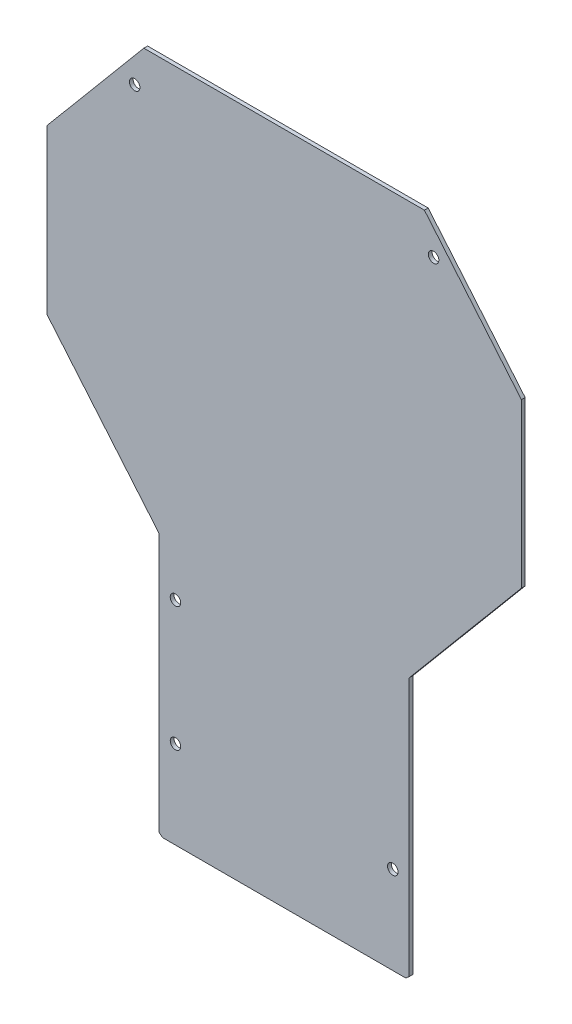
ISO-10303-21;
HEADER;
FILE_DESCRIPTION(('STEP AP214'),'2;1');
FILE_NAME('part.step','',(''),(''),'','','');
FILE_SCHEMA(('AUTOMOTIVE_DESIGN { 1 0 10303 214 1 1 1 1 }'));
ENDSEC;
DATA;
#1=APPLICATION_CONTEXT('core data for automotive mechanical design processes');
#2=APPLICATION_PROTOCOL_DEFINITION('international standard','automotive_design',2000,#1);
#3=PRODUCT_CONTEXT('',#1,'mechanical');
#4=PRODUCT('Part','Part','',(#3));
#5=PRODUCT_RELATED_PRODUCT_CATEGORY('part','',(#4));
#6=PRODUCT_DEFINITION_FORMATION('','',#4);
#7=PRODUCT_DEFINITION_CONTEXT('part definition',#1,'design');
#8=PRODUCT_DEFINITION('design','',#6,#7);
#9=PRODUCT_DEFINITION_SHAPE('','',#8);
#10=(LENGTH_UNIT() NAMED_UNIT(*) SI_UNIT(.MILLI.,.METRE.));
#11=(NAMED_UNIT(*) PLANE_ANGLE_UNIT() SI_UNIT($,.RADIAN.));
#12=(NAMED_UNIT(*) SI_UNIT($,.STERADIAN.) SOLID_ANGLE_UNIT());
#13=UNCERTAINTY_MEASURE_WITH_UNIT(LENGTH_MEASURE(1.E-05),#10,'distance_accuracy_value','');
#14=(GEOMETRIC_REPRESENTATION_CONTEXT(3) GLOBAL_UNCERTAINTY_ASSIGNED_CONTEXT((#13)) GLOBAL_UNIT_ASSIGNED_CONTEXT((#10,
#11,#12)) REPRESENTATION_CONTEXT('',''));
#15=CARTESIAN_POINT('',(0.,0.,0.));
#16=DIRECTION('',(0.,0.,1.));
#17=DIRECTION('',(1.,0.,0.));
#18=AXIS2_PLACEMENT_3D('',#15,#16,#17);
#19=CARTESIAN_POINT('',(49.1570232721275,-31.4887292628743,1.5));
#20=DIRECTION('',(-1.,0.,0.));
#21=DIRECTION('',(0.,-1.,0.));
#22=AXIS2_PLACEMENT_3D('',#19,#20,#21);
#23=PLANE('',#22);
#24=DIRECTION('',(0.,1.,0.));
#25=VECTOR('',#24,1.);
#26=CARTESIAN_POINT('',(49.1570232721275,-31.4887292628743,0.));
#27=LINE('',#26,#25);
#28=CARTESIAN_POINT('',(49.1570232721276,-135.082673957974,0.));
#29=VERTEX_POINT('',#28);
#30=CARTESIAN_POINT('',(49.1570232721275,-31.4887292628743,0.));
#31=VERTEX_POINT('',#30);
#32=EDGE_CURVE('E153',#29,#31,#27,.T.);
#33=ORIENTED_EDGE('',*,*,#32,.T.);
#34=DIRECTION('',(0.,0.,-1.));
#35=VECTOR('',#34,1.);
#36=CARTESIAN_POINT('',(49.1570232721275,-31.4887292628743,1.5));
#37=LINE('',#36,#35);
#38=CARTESIAN_POINT('',(49.1570232721275,-31.4887292628743,1.5));
#39=VERTEX_POINT('',#38);
#40=EDGE_CURVE('E11',#39,#31,#37,.T.);
#41=ORIENTED_EDGE('',*,*,#40,.F.);
#42=DIRECTION('',(0.,1.,0.));
#43=VECTOR('',#42,1.);
#44=CARTESIAN_POINT('',(49.1570232721275,-31.4887292628743,1.5));
#45=LINE('',#44,#43);
#46=CARTESIAN_POINT('',(49.1570232721276,-135.082673957974,1.5));
#47=VERTEX_POINT('',#46);
#48=EDGE_CURVE('E176',#47,#39,#45,.T.);
#49=ORIENTED_EDGE('',*,*,#48,.F.);
#50=DIRECTION('',(0.,0.,-1.));
#51=VECTOR('',#50,1.);
#52=CARTESIAN_POINT('',(49.1570232721276,-135.082673957974,1.5));
#53=LINE('',#52,#51);
#54=EDGE_CURVE('E149',#47,#29,#53,.T.);
#55=ORIENTED_EDGE('',*,*,#54,.T.);
#56=EDGE_LOOP('',(#33,#41,#49,#55));
#57=FACE_BOUND('',#56,.T.);
#58=ADVANCED_FACE('F33',(#57),#23,.F.);
#59=CARTESIAN_POINT('',(94.1570232721273,22.1401824038646,1.5));
#60=DIRECTION('',(-0.766044443118977,0.642787609686541,0.));
#61=DIRECTION('',(-0.642787609686541,-0.766044443118977,0.));
#62=AXIS2_PLACEMENT_3D('',#59,#60,#61);
#63=PLANE('',#62);
#64=DIRECTION('',(0.642787609686541,0.766044443118977,0.));
#65=VECTOR('',#64,1.);
#66=CARTESIAN_POINT('',(94.1570232721273,22.1401824038646,0.));
#67=LINE('',#66,#65);
#68=CARTESIAN_POINT('',(94.1570232721273,22.1401824038646,0.));
#69=VERTEX_POINT('',#68);
#70=EDGE_CURVE('E156',#31,#69,#67,.T.);
#71=ORIENTED_EDGE('',*,*,#70,.T.);
#72=DIRECTION('',(0.,0.,-1.));
#73=VECTOR('',#72,1.);
#74=CARTESIAN_POINT('',(94.1570232721273,22.1401824038646,1.5));
#75=LINE('',#74,#73);
#76=CARTESIAN_POINT('',(94.1570232721273,22.1401824038646,1.5));
#77=VERTEX_POINT('',#76);
#78=EDGE_CURVE('E41',#77,#69,#75,.T.);
#79=ORIENTED_EDGE('',*,*,#78,.F.);
#80=DIRECTION('',(0.642787609686541,0.766044443118977,0.));
#81=VECTOR('',#80,1.);
#82=CARTESIAN_POINT('',(94.1570232721273,22.1401824038646,1.5));
#83=LINE('',#82,#81);
#84=EDGE_CURVE('E104',#39,#77,#83,.T.);
#85=ORIENTED_EDGE('',*,*,#84,.F.);
#86=ORIENTED_EDGE('',*,*,#40,.T.);
#87=EDGE_LOOP('',(#71,#79,#85,#86));
#88=FACE_BOUND('',#87,.T.);
#89=ADVANCED_FACE('F255',(#88),#63,.F.);
#90=CARTESIAN_POINT('',(94.1570232721273,87.5266959780915,1.5));
#91=DIRECTION('',(-1.,0.,0.));
#92=DIRECTION('',(0.,-1.,0.));
#93=AXIS2_PLACEMENT_3D('',#90,#91,#92);
#94=PLANE('',#93);
#95=DIRECTION('',(0.,1.,0.));
#96=VECTOR('',#95,1.);
#97=CARTESIAN_POINT('',(94.1570232721273,87.5266959780915,0.));
#98=LINE('',#97,#96);
#99=CARTESIAN_POINT('',(94.1570232721273,87.5266959780915,0.));
#100=VERTEX_POINT('',#99);
#101=EDGE_CURVE('E159',#69,#100,#98,.T.);
#102=ORIENTED_EDGE('',*,*,#101,.T.);
#103=DIRECTION('',(0.,0.,-1.));
#104=VECTOR('',#103,1.);
#105=CARTESIAN_POINT('',(94.1570232721273,87.5266959780915,1.5));
#106=LINE('',#105,#104);
#107=CARTESIAN_POINT('',(94.1570232721273,87.5266959780915,1.5));
#108=VERTEX_POINT('',#107);
#109=EDGE_CURVE('E195',#108,#100,#106,.T.);
#110=ORIENTED_EDGE('',*,*,#109,.F.);
#111=DIRECTION('',(0.,1.,0.));
#112=VECTOR('',#111,1.);
#113=CARTESIAN_POINT('',(94.1570232721273,87.5266959780915,1.5));
#114=LINE('',#113,#112);
#115=EDGE_CURVE('E203',#77,#108,#114,.T.);
#116=ORIENTED_EDGE('',*,*,#115,.F.);
#117=ORIENTED_EDGE('',*,*,#78,.T.);
#118=EDGE_LOOP('',(#102,#110,#116,#117));
#119=FACE_BOUND('',#118,.T.);
#120=ADVANCED_FACE('F201',(#119),#94,.F.);
#121=CARTESIAN_POINT('',(55.3210460022655,133.809611411357,1.5));
#122=DIRECTION('',(-0.766044443118982,-0.642787609686534,0.));
#123=DIRECTION('',(0.642787609686534,-0.766044443118983,0.));
#124=AXIS2_PLACEMENT_3D('',#121,#122,#123);
#125=PLANE('',#124);
#126=DIRECTION('',(-0.642787609686534,0.766044443118982,0.));
#127=VECTOR('',#126,1.);
#128=CARTESIAN_POINT('',(55.3210460022655,133.809611411357,0.));
#129=LINE('',#128,#127);
#130=CARTESIAN_POINT('',(55.3210460022655,133.809611411357,0.));
#131=VERTEX_POINT('',#130);
#132=EDGE_CURVE('E161',#100,#131,#129,.T.);
#133=ORIENTED_EDGE('',*,*,#132,.T.);
#134=DIRECTION('',(0.,0.,-1.));
#135=VECTOR('',#134,1.);
#136=CARTESIAN_POINT('',(55.3210460022655,133.809611411357,1.5));
#137=LINE('',#136,#135);
#138=CARTESIAN_POINT('',(55.3210460022655,133.809611411357,1.5));
#139=VERTEX_POINT('',#138);
#140=EDGE_CURVE('E192',#139,#131,#137,.T.);
#141=ORIENTED_EDGE('',*,*,#140,.F.);
#142=DIRECTION('',(-0.642787609686534,0.766044443118982,0.));
#143=VECTOR('',#142,1.);
#144=CARTESIAN_POINT('',(55.3210460022655,133.809611411357,1.5));
#145=LINE('',#144,#143);
#146=EDGE_CURVE('E221',#108,#139,#145,.T.);
#147=ORIENTED_EDGE('',*,*,#146,.F.);
#148=ORIENTED_EDGE('',*,*,#109,.T.);
#149=EDGE_LOOP('',(#133,#141,#147,#148));
#150=FACE_BOUND('',#149,.T.);
#151=ADVANCED_FACE('F212',(#150),#125,.F.);
#152=CARTESIAN_POINT('',(55.3210460022655,133.809611411357,1.5));
#153=DIRECTION('',(0.,-1.,0.));
#154=DIRECTION('',(0.,0.,-1.));
#155=AXIS2_PLACEMENT_3D('',#152,#153,#154);
#156=PLANE('',#155);
#157=DIRECTION('',(-1.,0.,0.));
#158=VECTOR('',#157,1.);
#159=CARTESIAN_POINT('',(55.3210460022655,133.809611411357,0.));
#160=LINE('',#159,#158);
#161=CARTESIAN_POINT('',(-57.0069994580103,133.809611411357,0.));
#162=VERTEX_POINT('',#161);
#163=EDGE_CURVE('E163',#131,#162,#160,.T.);
#164=ORIENTED_EDGE('',*,*,#163,.T.);
#165=DIRECTION('',(0.,0.,-1.));
#166=VECTOR('',#165,1.);
#167=CARTESIAN_POINT('',(-57.0069994580103,133.809611411357,1.5));
#168=LINE('',#167,#166);
#169=CARTESIAN_POINT('',(-57.0069994580103,133.809611411357,1.5));
#170=VERTEX_POINT('',#169);
#171=EDGE_CURVE('E189',#170,#162,#168,.T.);
#172=ORIENTED_EDGE('',*,*,#171,.F.);
#173=DIRECTION('',(-1.,0.,0.));
#174=VECTOR('',#173,1.);
#175=CARTESIAN_POINT('',(55.3210460022655,133.809611411357,1.5));
#176=LINE('',#175,#174);
#177=EDGE_CURVE('E218',#139,#170,#176,.T.);
#178=ORIENTED_EDGE('',*,*,#177,.F.);
#179=ORIENTED_EDGE('',*,*,#140,.T.);
#180=EDGE_LOOP('',(#164,#172,#178,#179));
#181=FACE_BOUND('',#180,.T.);
#182=ADVANCED_FACE('F216',(#181),#156,.F.);
#183=CARTESIAN_POINT('',(-57.0069994580103,133.809611411357,1.5));
#184=DIRECTION('',(0.766044443118982,-0.642787609686534,0.));
#185=DIRECTION('',(0.642787609686534,0.766044443118983,0.));
#186=AXIS2_PLACEMENT_3D('',#183,#184,#185);
#187=PLANE('',#186);
#188=DIRECTION('',(-0.642787609686534,-0.766044443118982,0.));
#189=VECTOR('',#188,1.);
#190=CARTESIAN_POINT('',(-57.0069994580103,133.809611411357,0.));
#191=LINE('',#190,#189);
#192=CARTESIAN_POINT('',(-95.8429767278721,87.5266959780915,0.));
#193=VERTEX_POINT('',#192);
#194=EDGE_CURVE('E165',#162,#193,#191,.T.);
#195=ORIENTED_EDGE('',*,*,#194,.T.);
#196=DIRECTION('',(0.,0.,-1.));
#197=VECTOR('',#196,1.);
#198=CARTESIAN_POINT('',(-95.8429767278721,87.5266959780915,1.5));
#199=LINE('',#198,#197);
#200=CARTESIAN_POINT('',(-95.8429767278721,87.5266959780915,1.5));
#201=VERTEX_POINT('',#200);
#202=EDGE_CURVE('E186',#201,#193,#199,.T.);
#203=ORIENTED_EDGE('',*,*,#202,.F.);
#204=DIRECTION('',(-0.642787609686534,-0.766044443118982,0.));
#205=VECTOR('',#204,1.);
#206=CARTESIAN_POINT('',(-57.0069994580103,133.809611411357,1.5));
#207=LINE('',#206,#205);
#208=EDGE_CURVE('E220',#170,#201,#207,.T.);
#209=ORIENTED_EDGE('',*,*,#208,.F.);
#210=ORIENTED_EDGE('',*,*,#171,.T.);
#211=EDGE_LOOP('',(#195,#203,#209,#210));
#212=FACE_BOUND('',#211,.T.);
#213=ADVANCED_FACE('F268',(#212),#187,.F.);
#214=CARTESIAN_POINT('',(-95.8429767278721,87.5266959780915,1.5));
#215=DIRECTION('',(1.,0.,0.));
#216=DIRECTION('',(0.,1.,0.));
#217=AXIS2_PLACEMENT_3D('',#214,#215,#216);
#218=PLANE('',#217);
#219=DIRECTION('',(0.,-1.,0.));
#220=VECTOR('',#219,1.);
#221=CARTESIAN_POINT('',(-95.8429767278721,87.5266959780915,0.));
#222=LINE('',#221,#220);
#223=CARTESIAN_POINT('',(-95.8429767278721,22.1401824038646,0.));
#224=VERTEX_POINT('',#223);
#225=EDGE_CURVE('E167',#193,#224,#222,.T.);
#226=ORIENTED_EDGE('',*,*,#225,.T.);
#227=DIRECTION('',(0.,0.,-1.));
#228=VECTOR('',#227,1.);
#229=CARTESIAN_POINT('',(-95.8429767278721,22.1401824038646,1.5));
#230=LINE('',#229,#228);
#231=CARTESIAN_POINT('',(-95.8429767278721,22.1401824038646,1.5));
#232=VERTEX_POINT('',#231);
#233=EDGE_CURVE('E183',#232,#224,#230,.T.);
#234=ORIENTED_EDGE('',*,*,#233,.F.);
#235=DIRECTION('',(0.,-1.,0.));
#236=VECTOR('',#235,1.);
#237=CARTESIAN_POINT('',(-95.8429767278721,87.5266959780915,1.5));
#238=LINE('',#237,#236);
#239=EDGE_CURVE('E223',#201,#232,#238,.T.);
#240=ORIENTED_EDGE('',*,*,#239,.F.);
#241=ORIENTED_EDGE('',*,*,#202,.T.);
#242=EDGE_LOOP('',(#226,#234,#240,#241));
#243=FACE_BOUND('',#242,.T.);
#244=ADVANCED_FACE('F271',(#243),#218,.F.);
#245=CARTESIAN_POINT('',(-95.8429767278721,22.1401824038646,1.5));
#246=DIRECTION('',(0.766044443118977,0.642787609686541,0.));
#247=DIRECTION('',(-0.642787609686541,0.766044443118977,0.));
#248=AXIS2_PLACEMENT_3D('',#245,#246,#247);
#249=PLANE('',#248);
#250=DIRECTION('',(0.642787609686541,-0.766044443118977,0.));
#251=VECTOR('',#250,1.);
#252=CARTESIAN_POINT('',(-95.8429767278721,22.1401824038646,0.));
#253=LINE('',#252,#251);
#254=CARTESIAN_POINT('',(-50.8429767278723,-31.4887292628743,0.));
#255=VERTEX_POINT('',#254);
#256=EDGE_CURVE('E169',#224,#255,#253,.T.);
#257=ORIENTED_EDGE('',*,*,#256,.T.);
#258=DIRECTION('',(0.,0.,-1.));
#259=VECTOR('',#258,1.);
#260=CARTESIAN_POINT('',(-50.8429767278723,-31.4887292628743,1.5));
#261=LINE('',#260,#259);
#262=CARTESIAN_POINT('',(-50.8429767278723,-31.4887292628743,1.5));
#263=VERTEX_POINT('',#262);
#264=EDGE_CURVE('E180',#263,#255,#261,.T.);
#265=ORIENTED_EDGE('',*,*,#264,.F.);
#266=DIRECTION('',(0.642787609686541,-0.766044443118977,0.));
#267=VECTOR('',#266,1.);
#268=CARTESIAN_POINT('',(-95.8429767278721,22.1401824038646,1.5));
#269=LINE('',#268,#267);
#270=EDGE_CURVE('E229',#232,#263,#269,.T.);
#271=ORIENTED_EDGE('',*,*,#270,.F.);
#272=ORIENTED_EDGE('',*,*,#233,.T.);
#273=EDGE_LOOP('',(#257,#265,#271,#272));
#274=FACE_BOUND('',#273,.T.);
#275=ADVANCED_FACE('F235',(#274),#249,.F.);
#276=CARTESIAN_POINT('',(-50.8429767278723,-31.4887292628743,1.5));
#277=DIRECTION('',(1.,0.,0.));
#278=DIRECTION('',(0.,1.,0.));
#279=AXIS2_PLACEMENT_3D('',#276,#277,#278);
#280=PLANE('',#279);
#281=DIRECTION('',(0.,-1.,0.));
#282=VECTOR('',#281,1.);
#283=CARTESIAN_POINT('',(-50.8429767278723,-31.4887292628743,0.));
#284=LINE('',#283,#282);
#285=CARTESIAN_POINT('',(-50.8429767278723,-135.082673957974,0.));
#286=VERTEX_POINT('',#285);
#287=EDGE_CURVE('E171',#255,#286,#284,.T.);
#288=ORIENTED_EDGE('',*,*,#287,.T.);
#289=DIRECTION('',(0.,0.,-1.));
#290=VECTOR('',#289,1.);
#291=CARTESIAN_POINT('',(-50.8429767278723,-135.082673957974,1.5));
#292=LINE('',#291,#290);
#293=CARTESIAN_POINT('',(-50.8429767278723,-135.082673957974,1.5));
#294=VERTEX_POINT('',#293);
#295=EDGE_CURVE('E144',#294,#286,#292,.T.);
#296=ORIENTED_EDGE('',*,*,#295,.F.);
#297=DIRECTION('',(0.,-1.,0.));
#298=VECTOR('',#297,1.);
#299=CARTESIAN_POINT('',(-50.8429767278723,-31.4887292628743,1.5));
#300=LINE('',#299,#298);
#301=EDGE_CURVE('E135',#263,#294,#300,.T.);
#302=ORIENTED_EDGE('',*,*,#301,.F.);
#303=ORIENTED_EDGE('',*,*,#264,.T.);
#304=EDGE_LOOP('',(#288,#296,#302,#303));
#305=FACE_BOUND('',#304,.T.);
#306=ADVANCED_FACE('F239',(#305),#280,.F.);
#307=CARTESIAN_POINT('',(-50.8429767278723,-135.082673957974,1.5));
#308=DIRECTION('',(0.642787609686518,0.766044443118996,0.));
#309=DIRECTION('',(-0.766044443118996,0.642787609686518,0.));
#310=AXIS2_PLACEMENT_3D('',#307,#308,#309);
#311=PLANE('',#310);
#312=DIRECTION('',(0.766044443118996,-0.642787609686518,0.));
#313=VECTOR('',#312,1.);
#314=CARTESIAN_POINT('',(-50.8429767278723,-135.082673957974,0.));
#315=LINE('',#314,#313);
#316=CARTESIAN_POINT('',(-49.5228538372032,-136.190388588643,0.));
#317=VERTEX_POINT('',#316);
#318=EDGE_CURVE('E143',#286,#317,#315,.T.);
#319=ORIENTED_EDGE('',*,*,#318,.T.);
#320=DIRECTION('',(0.,0.,-1.));
#321=VECTOR('',#320,1.);
#322=CARTESIAN_POINT('',(-49.5228538372032,-136.190388588643,1.5));
#323=LINE('',#322,#321);
#324=CARTESIAN_POINT('',(-49.5228538372032,-136.190388588643,1.5));
#325=VERTEX_POINT('',#324);
#326=EDGE_CURVE('E140',#325,#317,#323,.T.);
#327=ORIENTED_EDGE('',*,*,#326,.F.);
#328=DIRECTION('',(0.766044443118996,-0.642787609686518,0.));
#329=VECTOR('',#328,1.);
#330=CARTESIAN_POINT('',(-50.8429767278723,-135.082673957974,1.5));
#331=LINE('',#330,#329);
#332=EDGE_CURVE('E129',#294,#325,#331,.T.);
#333=ORIENTED_EDGE('',*,*,#332,.F.);
#334=ORIENTED_EDGE('',*,*,#295,.T.);
#335=EDGE_LOOP('',(#319,#327,#333,#334));
#336=FACE_BOUND('',#335,.T.);
#337=ADVANCED_FACE('F141',(#336),#311,.F.);
#338=CARTESIAN_POINT('',(-49.5228538372032,-136.190388588643,1.5));
#339=DIRECTION('',(0.,1.,0.));
#340=DIRECTION('',(-1.,0.,0.));
#341=AXIS2_PLACEMENT_3D('',#338,#339,#340);
#342=PLANE('',#341);
#343=DIRECTION('',(1.,0.,0.));
#344=VECTOR('',#343,1.);
#345=CARTESIAN_POINT('',(-49.5228538372032,-136.190388588643,0.));
#346=LINE('',#345,#344);
#347=CARTESIAN_POINT('',(47.8369003814585,-136.190388588643,0.));
#348=VERTEX_POINT('',#347);
#349=EDGE_CURVE('E90',#317,#348,#346,.T.);
#350=ORIENTED_EDGE('',*,*,#349,.T.);
#351=DIRECTION('',(0.,0.,-1.));
#352=VECTOR('',#351,1.);
#353=CARTESIAN_POINT('',(47.8369003814585,-136.190388588643,1.5));
#354=LINE('',#353,#352);
#355=CARTESIAN_POINT('',(47.8369003814585,-136.190388588643,1.5));
#356=VERTEX_POINT('',#355);
#357=EDGE_CURVE('E145',#356,#348,#354,.T.);
#358=ORIENTED_EDGE('',*,*,#357,.F.);
#359=DIRECTION('',(1.,0.,0.));
#360=VECTOR('',#359,1.);
#361=CARTESIAN_POINT('',(-49.5228538372032,-136.190388588643,1.5));
#362=LINE('',#361,#360);
#363=EDGE_CURVE('E133',#325,#356,#362,.T.);
#364=ORIENTED_EDGE('',*,*,#363,.F.);
#365=ORIENTED_EDGE('',*,*,#326,.T.);
#366=EDGE_LOOP('',(#350,#358,#364,#365));
#367=FACE_BOUND('',#366,.T.);
#368=ADVANCED_FACE('F147',(#367),#342,.F.);
#369=CARTESIAN_POINT('',(49.1570232721276,-135.082673957974,1.5));
#370=DIRECTION('',(-0.642787609686531,0.766044443118985,0.));
#371=DIRECTION('',(-0.766044443118985,-0.642787609686531,0.));
#372=AXIS2_PLACEMENT_3D('',#369,#370,#371);
#373=PLANE('',#372);
#374=DIRECTION('',(0.766044443118985,0.642787609686531,0.));
#375=VECTOR('',#374,1.);
#376=CARTESIAN_POINT('',(49.1570232721276,-135.082673957974,0.));
#377=LINE('',#376,#375);
#378=EDGE_CURVE('E96',#348,#29,#377,.T.);
#379=ORIENTED_EDGE('',*,*,#378,.T.);
#380=ORIENTED_EDGE('',*,*,#54,.F.);
#381=DIRECTION('',(0.766044443118985,0.642787609686531,0.));
#382=VECTOR('',#381,1.);
#383=CARTESIAN_POINT('',(49.1570232721276,-135.082673957974,1.5));
#384=LINE('',#383,#382);
#385=EDGE_CURVE('E49',#356,#47,#384,.T.);
#386=ORIENTED_EDGE('',*,*,#385,.F.);
#387=ORIENTED_EDGE('',*,*,#357,.T.);
#388=EDGE_LOOP('',(#379,#380,#386,#387));
#389=FACE_BOUND('',#388,.T.);
#390=ADVANCED_FACE('F243',(#389),#373,.F.);
#391=CARTESIAN_POINT('',(0.,0.,1.5));
#392=DIRECTION('',(0.,0.,1.));
#393=DIRECTION('',(1.,0.,0.));
#394=AXIS2_PLACEMENT_3D('',#391,#392,#393);
#395=PLANE('',#394);
#396=CARTESIAN_POINT('',(-44.3429767278723,-51.1903885886428,1.5));
#397=DIRECTION('',(0.,0.,1.));
#398=DIRECTION('',(1.,0.,0.));
#399=AXIS2_PLACEMENT_3D('',#396,#397,#398);
#400=CIRCLE('',#399,2.1);
#401=CARTESIAN_POINT('',(-42.2429767278723,-51.1903885886428,1.5));
#402=VERTEX_POINT('',#401);
#403=EDGE_CURVE('E364',#402,#402,#400,.T.);
#404=ORIENTED_EDGE('',*,*,#403,.F.);
#405=EDGE_LOOP('',(#404));
#406=FACE_BOUND('',#405,.T.);
#407=CARTESIAN_POINT('',(58.9989798659813,119.314215641357,1.5));
#408=DIRECTION('',(0.,0.,1.));
#409=DIRECTION('',(-1.,0.,0.));
#410=AXIS2_PLACEMENT_3D('',#407,#408,#409);
#411=CIRCLE('',#410,2.09999999999997);
#412=CARTESIAN_POINT('',(56.8989798659813,119.314215641357,1.5));
#413=VERTEX_POINT('',#412);
#414=EDGE_CURVE('E368',#413,#413,#411,.T.);
#415=ORIENTED_EDGE('',*,*,#414,.F.);
#416=EDGE_LOOP('',(#415));
#417=FACE_BOUND('',#416,.T.);
#418=CARTESIAN_POINT('',(-44.3429767278723,-101.030388588643,1.5));
#419=DIRECTION('',(0.,0.,1.));
#420=DIRECTION('',(1.,0.,0.));
#421=AXIS2_PLACEMENT_3D('',#418,#419,#420);
#422=CIRCLE('',#421,2.1);
#423=CARTESIAN_POINT('',(-42.2429767278723,-101.030388588643,1.5));
#424=VERTEX_POINT('',#423);
#425=EDGE_CURVE('E377',#424,#424,#422,.T.);
#426=ORIENTED_EDGE('',*,*,#425,.F.);
#427=EDGE_LOOP('',(#426));
#428=FACE_BOUND('',#427,.T.);
#429=CARTESIAN_POINT('',(-60.684933321726,119.314215641357,1.5));
#430=DIRECTION('',(0.,0.,1.));
#431=DIRECTION('',(1.,0.,0.));
#432=AXIS2_PLACEMENT_3D('',#429,#430,#431);
#433=CIRCLE('',#432,2.1);
#434=CARTESIAN_POINT('',(-58.584933321726,119.314215641357,1.5));
#435=VERTEX_POINT('',#434);
#436=EDGE_CURVE('E383',#435,#435,#433,.T.);
#437=ORIENTED_EDGE('',*,*,#436,.F.);
#438=EDGE_LOOP('',(#437));
#439=FACE_BOUND('',#438,.T.);
#440=CARTESIAN_POINT('',(42.6570232721276,-101.030388588643,1.5));
#441=DIRECTION('',(0.,0.,1.));
#442=DIRECTION('',(-1.,0.,0.));
#443=AXIS2_PLACEMENT_3D('',#440,#441,#442);
#444=CIRCLE('',#443,2.1);
#445=CARTESIAN_POINT('',(40.5570232721276,-101.030388588643,1.5));
#446=VERTEX_POINT('',#445);
#447=EDGE_CURVE('E389',#446,#446,#444,.T.);
#448=ORIENTED_EDGE('',*,*,#447,.F.);
#449=EDGE_LOOP('',(#448));
#450=FACE_BOUND('',#449,.T.);
#451=ORIENTED_EDGE('',*,*,#48,.T.);
#452=ORIENTED_EDGE('',*,*,#84,.T.);
#453=ORIENTED_EDGE('',*,*,#115,.T.);
#454=ORIENTED_EDGE('',*,*,#146,.T.);
#455=ORIENTED_EDGE('',*,*,#177,.T.);
#456=ORIENTED_EDGE('',*,*,#208,.T.);
#457=ORIENTED_EDGE('',*,*,#239,.T.);
#458=ORIENTED_EDGE('',*,*,#270,.T.);
#459=ORIENTED_EDGE('',*,*,#301,.T.);
#460=ORIENTED_EDGE('',*,*,#332,.T.);
#461=ORIENTED_EDGE('',*,*,#363,.T.);
#462=ORIENTED_EDGE('',*,*,#385,.T.);
#463=EDGE_LOOP('',(#451,#452,#453,#454,#455,#456,#457,#458,#459,#460,#461,#462));
#464=FACE_BOUND('',#463,.T.);
#465=ADVANCED_FACE('F131',(#406,#417,#428,#439,#450,#464),#395,.T.);
#466=CARTESIAN_POINT('',(0.,0.,0.));
#467=DIRECTION('',(0.,0.,1.));
#468=DIRECTION('',(1.,0.,0.));
#469=AXIS2_PLACEMENT_3D('',#466,#467,#468);
#470=PLANE('',#469);
#471=CARTESIAN_POINT('',(-44.3429767278723,-51.1903885886428,0.));
#472=DIRECTION('',(0.,0.,1.));
#473=DIRECTION('',(1.,0.,0.));
#474=AXIS2_PLACEMENT_3D('',#471,#472,#473);
#475=CIRCLE('',#474,2.1);
#476=CARTESIAN_POINT('',(-42.2429767278723,-51.1903885886428,0.));
#477=VERTEX_POINT('',#476);
#478=EDGE_CURVE('E367',#477,#477,#475,.F.);
#479=ORIENTED_EDGE('',*,*,#478,.F.);
#480=EDGE_LOOP('',(#479));
#481=FACE_BOUND('',#480,.T.);
#482=CARTESIAN_POINT('',(58.9989798659813,119.314215641357,0.));
#483=DIRECTION('',(0.,0.,1.));
#484=DIRECTION('',(1.,0.,0.));
#485=AXIS2_PLACEMENT_3D('',#482,#483,#484);
#486=CIRCLE('',#485,2.09999999999997);
#487=CARTESIAN_POINT('',(61.0989798659813,119.314215641357,0.));
#488=VERTEX_POINT('',#487);
#489=EDGE_CURVE('E371',#488,#488,#486,.F.);
#490=ORIENTED_EDGE('',*,*,#489,.F.);
#491=EDGE_LOOP('',(#490));
#492=FACE_BOUND('',#491,.T.);
#493=CARTESIAN_POINT('',(-44.3429767278723,-101.030388588643,0.));
#494=DIRECTION('',(0.,0.,1.));
#495=DIRECTION('',(1.,0.,0.));
#496=AXIS2_PLACEMENT_3D('',#493,#494,#495);
#497=CIRCLE('',#496,2.1);
#498=CARTESIAN_POINT('',(-42.2429767278723,-101.030388588643,0.));
#499=VERTEX_POINT('',#498);
#500=EDGE_CURVE('E380',#499,#499,#497,.F.);
#501=ORIENTED_EDGE('',*,*,#500,.F.);
#502=EDGE_LOOP('',(#501));
#503=FACE_BOUND('',#502,.T.);
#504=CARTESIAN_POINT('',(-60.684933321726,119.314215641357,0.));
#505=DIRECTION('',(0.,0.,1.));
#506=DIRECTION('',(1.,0.,0.));
#507=AXIS2_PLACEMENT_3D('',#504,#505,#506);
#508=CIRCLE('',#507,2.1);
#509=CARTESIAN_POINT('',(-58.584933321726,119.314215641357,0.));
#510=VERTEX_POINT('',#509);
#511=EDGE_CURVE('E386',#510,#510,#508,.F.);
#512=ORIENTED_EDGE('',*,*,#511,.F.);
#513=EDGE_LOOP('',(#512));
#514=FACE_BOUND('',#513,.T.);
#515=CARTESIAN_POINT('',(42.6570232721276,-101.030388588643,0.));
#516=DIRECTION('',(0.,0.,1.));
#517=DIRECTION('',(1.,0.,0.));
#518=AXIS2_PLACEMENT_3D('',#515,#516,#517);
#519=CIRCLE('',#518,2.1);
#520=CARTESIAN_POINT('',(44.7570232721276,-101.030388588643,0.));
#521=VERTEX_POINT('',#520);
#522=EDGE_CURVE('E157',#521,#521,#519,.F.);
#523=ORIENTED_EDGE('',*,*,#522,.F.);
#524=EDGE_LOOP('',(#523));
#525=FACE_BOUND('',#524,.T.);
#526=ORIENTED_EDGE('',*,*,#32,.F.);
#527=ORIENTED_EDGE('',*,*,#378,.F.);
#528=ORIENTED_EDGE('',*,*,#349,.F.);
#529=ORIENTED_EDGE('',*,*,#318,.F.);
#530=ORIENTED_EDGE('',*,*,#287,.F.);
#531=ORIENTED_EDGE('',*,*,#256,.F.);
#532=ORIENTED_EDGE('',*,*,#225,.F.);
#533=ORIENTED_EDGE('',*,*,#194,.F.);
#534=ORIENTED_EDGE('',*,*,#163,.F.);
#535=ORIENTED_EDGE('',*,*,#132,.F.);
#536=ORIENTED_EDGE('',*,*,#101,.F.);
#537=ORIENTED_EDGE('',*,*,#70,.F.);
#538=EDGE_LOOP('',(#526,#527,#528,#529,#530,#531,#532,#533,#534,#535,#536,#537));
#539=FACE_BOUND('',#538,.T.);
#540=ADVANCED_FACE('F207',(#481,#492,#503,#514,#525,#539),#470,.F.);
#541=CARTESIAN_POINT('',(42.6570232721276,-101.030388588643,-0.000999999999999916));
#542=DIRECTION('',(0.,0.,1.));
#543=DIRECTION('',(1.,0.,0.));
#544=AXIS2_PLACEMENT_3D('',#541,#542,#543);
#545=CYLINDRICAL_SURFACE('',#544,2.1);
#546=ORIENTED_EDGE('',*,*,#447,.T.);
#547=EDGE_LOOP('',(#546));
#548=FACE_BOUND('',#547,.T.);
#549=ORIENTED_EDGE('',*,*,#522,.T.);
#550=EDGE_LOOP('',(#549));
#551=FACE_BOUND('',#550,.T.);
#552=ADVANCED_FACE('F308',(#548,#551),#545,.F.);
#553=CARTESIAN_POINT('',(-60.684933321726,119.314215641357,-0.000999999999999916));
#554=DIRECTION('',(0.,0.,1.));
#555=DIRECTION('',(1.,0.,0.));
#556=AXIS2_PLACEMENT_3D('',#553,#554,#555);
#557=CYLINDRICAL_SURFACE('',#556,2.1);
#558=ORIENTED_EDGE('',*,*,#436,.T.);
#559=EDGE_LOOP('',(#558));
#560=FACE_BOUND('',#559,.T.);
#561=ORIENTED_EDGE('',*,*,#511,.T.);
#562=EDGE_LOOP('',(#561));
#563=FACE_BOUND('',#562,.T.);
#564=ADVANCED_FACE('F317',(#560,#563),#557,.F.);
#565=CARTESIAN_POINT('',(-44.3429767278723,-101.030388588643,-0.000999999999999916));
#566=DIRECTION('',(0.,0.,1.));
#567=DIRECTION('',(1.,0.,0.));
#568=AXIS2_PLACEMENT_3D('',#565,#566,#567);
#569=CYLINDRICAL_SURFACE('',#568,2.1);
#570=ORIENTED_EDGE('',*,*,#425,.T.);
#571=EDGE_LOOP('',(#570));
#572=FACE_BOUND('',#571,.T.);
#573=ORIENTED_EDGE('',*,*,#500,.T.);
#574=EDGE_LOOP('',(#573));
#575=FACE_BOUND('',#574,.T.);
#576=ADVANCED_FACE('F327',(#572,#575),#569,.F.);
#577=CARTESIAN_POINT('',(58.9989798659813,119.314215641357,-0.000999999999999916));
#578=DIRECTION('',(0.,0.,1.));
#579=DIRECTION('',(1.,0.,0.));
#580=AXIS2_PLACEMENT_3D('',#577,#578,#579);
#581=CYLINDRICAL_SURFACE('',#580,2.09999999999997);
#582=ORIENTED_EDGE('',*,*,#414,.T.);
#583=EDGE_LOOP('',(#582));
#584=FACE_BOUND('',#583,.T.);
#585=ORIENTED_EDGE('',*,*,#489,.T.);
#586=EDGE_LOOP('',(#585));
#587=FACE_BOUND('',#586,.T.);
#588=ADVANCED_FACE('F337',(#584,#587),#581,.F.);
#589=CARTESIAN_POINT('',(-44.3429767278723,-51.1903885886428,-0.000999999999999916));
#590=DIRECTION('',(0.,0.,1.));
#591=DIRECTION('',(1.,0.,0.));
#592=AXIS2_PLACEMENT_3D('',#589,#590,#591);
#593=CYLINDRICAL_SURFACE('',#592,2.1);
#594=ORIENTED_EDGE('',*,*,#403,.T.);
#595=EDGE_LOOP('',(#594));
#596=FACE_BOUND('',#595,.T.);
#597=ORIENTED_EDGE('',*,*,#478,.T.);
#598=EDGE_LOOP('',(#597));
#599=FACE_BOUND('',#598,.T.);
#600=ADVANCED_FACE('F347',(#596,#599),#593,.F.);
#601=CLOSED_SHELL('',(#58,#89,#120,#151,#182,#213,#244,#275,#306,#337,#368,#390,#465,#540,#552,
#564,#576,#588,#600));
#602=MANIFOLD_SOLID_BREP('B2',#601);
#603=ADVANCED_BREP_SHAPE_REPRESENTATION('',(#18,#602),#14);
#604=SHAPE_DEFINITION_REPRESENTATION(#9,#603);
ENDSEC;
END-ISO-10303-21;
